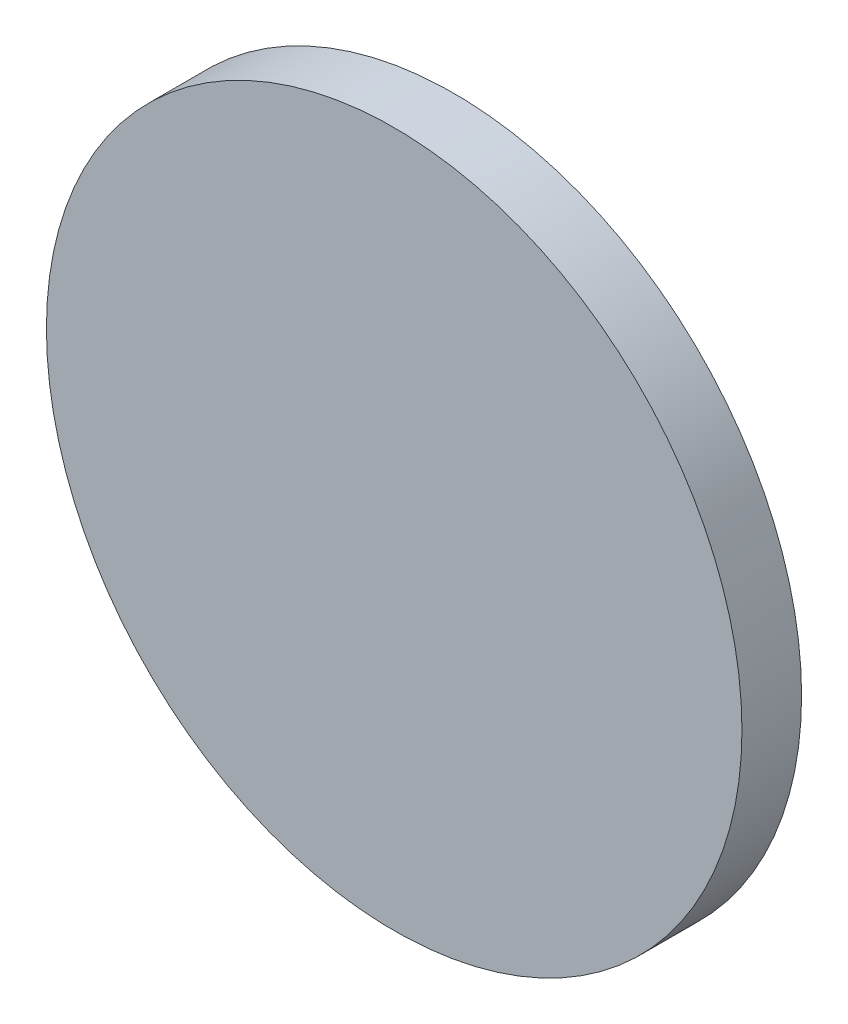
ISO-10303-21;
HEADER;
FILE_DESCRIPTION(('STEP AP214'),'2;1');
FILE_NAME('part.step','',(''),(''),'','','');
FILE_SCHEMA(('AUTOMOTIVE_DESIGN { 1 0 10303 214 1 1 1 1 }'));
ENDSEC;
DATA;
#1=APPLICATION_CONTEXT('core data for automotive mechanical design processes');
#2=APPLICATION_PROTOCOL_DEFINITION('international standard','automotive_design',2000,#1);
#3=PRODUCT_CONTEXT('',#1,'mechanical');
#4=PRODUCT('Part','Part','',(#3));
#5=PRODUCT_RELATED_PRODUCT_CATEGORY('part','',(#4));
#6=PRODUCT_DEFINITION_FORMATION('','',#4);
#7=PRODUCT_DEFINITION_CONTEXT('part definition',#1,'design');
#8=PRODUCT_DEFINITION('design','',#6,#7);
#9=PRODUCT_DEFINITION_SHAPE('','',#8);
#10=(LENGTH_UNIT() NAMED_UNIT(*) SI_UNIT(.MILLI.,.METRE.));
#11=(NAMED_UNIT(*) PLANE_ANGLE_UNIT() SI_UNIT($,.RADIAN.));
#12=(NAMED_UNIT(*) SI_UNIT($,.STERADIAN.) SOLID_ANGLE_UNIT());
#13=UNCERTAINTY_MEASURE_WITH_UNIT(LENGTH_MEASURE(1.E-05),#10,'distance_accuracy_value','');
#14=(GEOMETRIC_REPRESENTATION_CONTEXT(3) GLOBAL_UNCERTAINTY_ASSIGNED_CONTEXT((#13)) GLOBAL_UNIT_ASSIGNED_CONTEXT((#10,
#11,#12)) REPRESENTATION_CONTEXT('',''));
#15=CARTESIAN_POINT('',(0.,0.,0.));
#16=DIRECTION('',(0.,0.,1.));
#17=DIRECTION('',(1.,0.,0.));
#18=AXIS2_PLACEMENT_3D('',#15,#16,#17);
#19=CARTESIAN_POINT('',(5.6388,5.68452,0.));
#20=DIRECTION('',(0.,0.,-1.));
#21=DIRECTION('',(-1.,0.,0.));
#22=AXIS2_PLACEMENT_3D('',#19,#20,#21);
#23=PLANE('',#22);
#24=CARTESIAN_POINT('',(5.6388,5.68452,0.));
#25=DIRECTION('',(0.,0.,1.));
#26=DIRECTION('',(1.,0.,0.));
#27=AXIS2_PLACEMENT_3D('',#24,#25,#26);
#28=CIRCLE('',#27,0.200024667);
#29=CARTESIAN_POINT('',(5.838824667,5.68452,0.));
#30=VERTEX_POINT('',#29);
#31=EDGE_CURVE('E18',#30,#30,#28,.T.);
#32=ORIENTED_EDGE('',*,*,#31,.F.);
#33=EDGE_LOOP('',(#32));
#34=FACE_BOUND('',#33,.T.);
#35=ADVANCED_FACE('F15',(#34),#23,.T.);
#36=CARTESIAN_POINT('',(5.6388,5.68452,0.));
#37=DIRECTION('',(0.,0.,1.));
#38=DIRECTION('',(1.,0.,0.));
#39=AXIS2_PLACEMENT_3D('',#36,#37,#38);
#40=CYLINDRICAL_SURFACE('',#39,0.200024667);
#41=CARTESIAN_POINT('',(5.6388,5.68452,0.03429));
#42=DIRECTION('',(0.,0.,1.));
#43=DIRECTION('',(1.,0.,0.));
#44=AXIS2_PLACEMENT_3D('',#41,#42,#43);
#45=CIRCLE('',#44,0.200024667);
#46=CARTESIAN_POINT('',(5.838824667,5.68452,0.03429));
#47=VERTEX_POINT('',#46);
#48=EDGE_CURVE('E10',#47,#47,#45,.T.);
#49=ORIENTED_EDGE('',*,*,#48,.F.);
#50=EDGE_LOOP('',(#49));
#51=FACE_BOUND('',#50,.T.);
#52=ORIENTED_EDGE('',*,*,#31,.T.);
#53=EDGE_LOOP('',(#52));
#54=FACE_BOUND('',#53,.T.);
#55=ADVANCED_FACE('F27',(#51,#54),#40,.T.);
#56=CARTESIAN_POINT('',(5.6388,5.68452,0.03429));
#57=DIRECTION('',(0.,0.,1.));
#58=DIRECTION('',(1.,0.,0.));
#59=AXIS2_PLACEMENT_3D('',#56,#57,#58);
#60=PLANE('',#59);
#61=ORIENTED_EDGE('',*,*,#48,.T.);
#62=EDGE_LOOP('',(#61));
#63=FACE_BOUND('',#62,.T.);
#64=ADVANCED_FACE('F34',(#63),#60,.T.);
#65=CLOSED_SHELL('',(#35,#55,#64));
#66=MANIFOLD_SOLID_BREP('B1',#65);
#67=ADVANCED_BREP_SHAPE_REPRESENTATION('',(#18,#66),#14);
#68=SHAPE_DEFINITION_REPRESENTATION(#9,#67);
ENDSEC;
END-ISO-10303-21;
